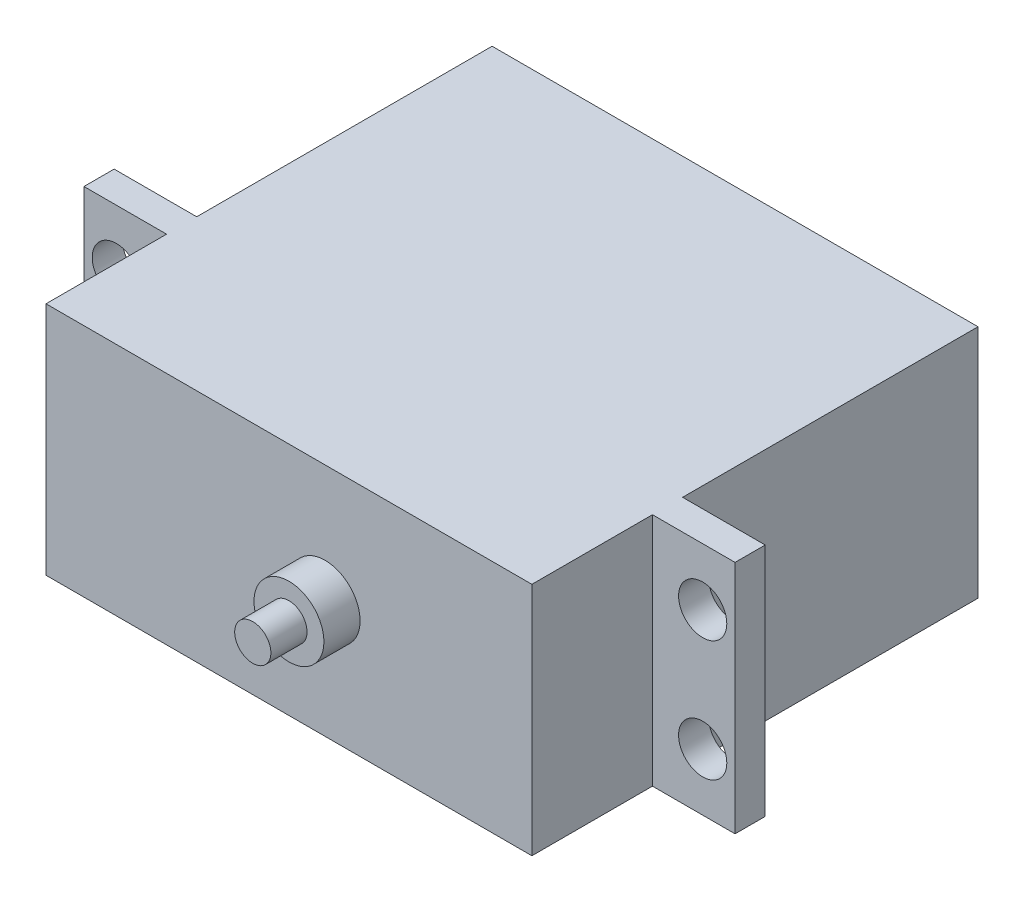
ISO-10303-21;
HEADER;
FILE_DESCRIPTION(('STEP AP214'),'2;1');
FILE_NAME('part.step','',(''),(''),'','','');
FILE_SCHEMA(('AUTOMOTIVE_DESIGN { 1 0 10303 214 1 1 1 1 }'));
ENDSEC;
DATA;
#1=APPLICATION_CONTEXT('core data for automotive mechanical design processes');
#2=APPLICATION_PROTOCOL_DEFINITION('international standard','automotive_design',2000,#1);
#3=PRODUCT_CONTEXT('',#1,'mechanical');
#4=PRODUCT('Part','Part','',(#3));
#5=PRODUCT_RELATED_PRODUCT_CATEGORY('part','',(#4));
#6=PRODUCT_DEFINITION_FORMATION('','',#4);
#7=PRODUCT_DEFINITION_CONTEXT('part definition',#1,'design');
#8=PRODUCT_DEFINITION('design','',#6,#7);
#9=PRODUCT_DEFINITION_SHAPE('','',#8);
#10=(LENGTH_UNIT() NAMED_UNIT(*) SI_UNIT(.MILLI.,.METRE.));
#11=(NAMED_UNIT(*) PLANE_ANGLE_UNIT() SI_UNIT($,.RADIAN.));
#12=(NAMED_UNIT(*) SI_UNIT($,.STERADIAN.) SOLID_ANGLE_UNIT());
#13=UNCERTAINTY_MEASURE_WITH_UNIT(LENGTH_MEASURE(1.E-05),#10,'distance_accuracy_value','');
#14=(GEOMETRIC_REPRESENTATION_CONTEXT(3) GLOBAL_UNCERTAINTY_ASSIGNED_CONTEXT((#13)) GLOBAL_UNIT_ASSIGNED_CONTEXT((#10,
#11,#12)) REPRESENTATION_CONTEXT('',''));
#15=CARTESIAN_POINT('',(0.,0.,0.));
#16=DIRECTION('',(0.,0.,1.));
#17=DIRECTION('',(1.,0.,0.));
#18=AXIS2_PLACEMENT_3D('',#15,#16,#17);
#19=CARTESIAN_POINT('',(20.15,9.75,37.));
#20=DIRECTION('',(-1.,0.,0.));
#21=DIRECTION('',(0.,-1.,0.));
#22=AXIS2_PLACEMENT_3D('',#19,#20,#21);
#23=PLANE('',#22);
#24=DIRECTION('',(0.,1.,0.));
#25=VECTOR('',#24,1.);
#26=CARTESIAN_POINT('',(20.15,9.75,24.5));
#27=LINE('',#26,#25);
#28=CARTESIAN_POINT('',(20.15,-9.75,24.5));
#29=VERTEX_POINT('',#28);
#30=CARTESIAN_POINT('',(20.15,9.75,24.5));
#31=VERTEX_POINT('',#30);
#32=EDGE_CURVE('E144',#29,#31,#27,.T.);
#33=ORIENTED_EDGE('',*,*,#32,.F.);
#34=DIRECTION('',(0.,0.,-1.));
#35=VECTOR('',#34,1.);
#36=CARTESIAN_POINT('',(20.15,-9.75,37.));
#37=LINE('',#36,#35);
#38=CARTESIAN_POINT('',(20.15,-9.75,0.));
#39=VERTEX_POINT('',#38);
#40=EDGE_CURVE('E203',#29,#39,#37,.T.);
#41=ORIENTED_EDGE('',*,*,#40,.T.);
#42=DIRECTION('',(0.,1.,0.));
#43=VECTOR('',#42,1.);
#44=CARTESIAN_POINT('',(20.15,9.75,0.));
#45=LINE('',#44,#43);
#46=CARTESIAN_POINT('',(20.15,9.75,0.));
#47=VERTEX_POINT('',#46);
#48=EDGE_CURVE('E189',#39,#47,#45,.T.);
#49=ORIENTED_EDGE('',*,*,#48,.T.);
#50=DIRECTION('',(0.,0.,-1.));
#51=VECTOR('',#50,1.);
#52=CARTESIAN_POINT('',(20.15,9.75,37.));
#53=LINE('',#52,#51);
#54=EDGE_CURVE('E225',#31,#47,#53,.T.);
#55=ORIENTED_EDGE('',*,*,#54,.F.);
#56=EDGE_LOOP('',(#33,#41,#49,#55));
#57=FACE_BOUND('',#56,.T.);
#58=ADVANCED_FACE('F35',(#57),#23,.F.);
#59=CARTESIAN_POINT('',(-20.15,9.75,37.));
#60=DIRECTION('',(1.,0.,0.));
#61=DIRECTION('',(0.,1.,0.));
#62=AXIS2_PLACEMENT_3D('',#59,#60,#61);
#63=PLANE('',#62);
#64=DIRECTION('',(0.,-1.,0.));
#65=VECTOR('',#64,1.);
#66=CARTESIAN_POINT('',(-20.15,9.75,24.5));
#67=LINE('',#66,#65);
#68=CARTESIAN_POINT('',(-20.15,9.75,24.5));
#69=VERTEX_POINT('',#68);
#70=CARTESIAN_POINT('',(-20.15,-9.75,24.5));
#71=VERTEX_POINT('',#70);
#72=EDGE_CURVE('E180',#69,#71,#67,.T.);
#73=ORIENTED_EDGE('',*,*,#72,.F.);
#74=DIRECTION('',(0.,0.,-1.));
#75=VECTOR('',#74,1.);
#76=CARTESIAN_POINT('',(-20.15,9.75,37.));
#77=LINE('',#76,#75);
#78=CARTESIAN_POINT('',(-20.15,9.75,0.));
#79=VERTEX_POINT('',#78);
#80=EDGE_CURVE('E221',#69,#79,#77,.T.);
#81=ORIENTED_EDGE('',*,*,#80,.T.);
#82=DIRECTION('',(0.,-1.,0.));
#83=VECTOR('',#82,1.);
#84=CARTESIAN_POINT('',(-20.15,9.75,0.));
#85=LINE('',#84,#83);
#86=CARTESIAN_POINT('',(-20.15,-9.75,0.));
#87=VERTEX_POINT('',#86);
#88=EDGE_CURVE('E209',#79,#87,#85,.T.);
#89=ORIENTED_EDGE('',*,*,#88,.T.);
#90=DIRECTION('',(0.,0.,-1.));
#91=VECTOR('',#90,1.);
#92=CARTESIAN_POINT('',(-20.15,-9.75,37.));
#93=LINE('',#92,#91);
#94=EDGE_CURVE('E217',#71,#87,#93,.T.);
#95=ORIENTED_EDGE('',*,*,#94,.F.);
#96=EDGE_LOOP('',(#73,#81,#89,#95));
#97=FACE_BOUND('',#96,.T.);
#98=ADVANCED_FACE('F285',(#97),#63,.F.);
#99=CARTESIAN_POINT('',(20.15,-9.75,37.));
#100=VERTEX_POINT('',#99);
#101=CARTESIAN_POINT('',(20.15,-9.75,27.));
#102=VERTEX_POINT('',#101);
#103=EDGE_CURVE('E214',#100,#102,#37,.T.);
#104=ORIENTED_EDGE('',*,*,#103,.T.);
#105=DIRECTION('',(0.,1.,0.));
#106=VECTOR('',#105,1.);
#107=CARTESIAN_POINT('',(20.15,9.75,27.));
#108=LINE('',#107,#106);
#109=CARTESIAN_POINT('',(20.15,9.75,27.));
#110=VERTEX_POINT('',#109);
#111=EDGE_CURVE('E178',#102,#110,#108,.T.);
#112=ORIENTED_EDGE('',*,*,#111,.T.);
#113=CARTESIAN_POINT('',(20.15,9.75,37.));
#114=VERTEX_POINT('',#113);
#115=EDGE_CURVE('E192',#114,#110,#53,.T.);
#116=ORIENTED_EDGE('',*,*,#115,.F.);
#117=DIRECTION('',(0.,1.,0.));
#118=VECTOR('',#117,1.);
#119=CARTESIAN_POINT('',(20.15,9.75,37.));
#120=LINE('',#119,#118);
#121=EDGE_CURVE('E193',#100,#114,#120,.T.);
#122=ORIENTED_EDGE('',*,*,#121,.F.);
#123=EDGE_LOOP('',(#104,#112,#116,#122));
#124=FACE_BOUND('',#123,.T.);
#125=ADVANCED_FACE('F37',(#124),#23,.F.);
#126=CARTESIAN_POINT('',(-20.15,9.75,37.));
#127=DIRECTION('',(0.,-1.,0.));
#128=DIRECTION('',(0.,0.,-1.));
#129=AXIS2_PLACEMENT_3D('',#126,#127,#128);
#130=PLANE('',#129);
#131=ORIENTED_EDGE('',*,*,#115,.T.);
#132=DIRECTION('',(-1.,0.,0.));
#133=VECTOR('',#132,1.);
#134=CARTESIAN_POINT('',(-27.,9.75,27.));
#135=LINE('',#134,#133);
#136=CARTESIAN_POINT('',(27.,9.75,27.));
#137=VERTEX_POINT('',#136);
#138=EDGE_CURVE('E52',#137,#110,#135,.T.);
#139=ORIENTED_EDGE('',*,*,#138,.F.);
#140=DIRECTION('',(0.,0.,1.));
#141=VECTOR('',#140,1.);
#142=CARTESIAN_POINT('',(27.,9.75,24.5));
#143=LINE('',#142,#141);
#144=CARTESIAN_POINT('',(27.,9.75,24.5));
#145=VERTEX_POINT('',#144);
#146=EDGE_CURVE('E127',#145,#137,#143,.T.);
#147=ORIENTED_EDGE('',*,*,#146,.F.);
#148=DIRECTION('',(-1.,0.,0.));
#149=VECTOR('',#148,1.);
#150=CARTESIAN_POINT('',(-27.,9.75,24.5));
#151=LINE('',#150,#149);
#152=EDGE_CURVE('E131',#145,#31,#151,.T.);
#153=ORIENTED_EDGE('',*,*,#152,.T.);
#154=ORIENTED_EDGE('',*,*,#54,.T.);
#155=DIRECTION('',(-1.,0.,0.));
#156=VECTOR('',#155,1.);
#157=CARTESIAN_POINT('',(-20.15,9.75,0.));
#158=LINE('',#157,#156);
#159=EDGE_CURVE('E206',#47,#79,#158,.T.);
#160=ORIENTED_EDGE('',*,*,#159,.T.);
#161=ORIENTED_EDGE('',*,*,#80,.F.);
#162=CARTESIAN_POINT('',(-27.,9.75,24.5));
#163=VERTEX_POINT('',#162);
#164=EDGE_CURVE('E146',#69,#163,#151,.T.);
#165=ORIENTED_EDGE('',*,*,#164,.T.);
#166=DIRECTION('',(0.,0.,1.));
#167=VECTOR('',#166,1.);
#168=CARTESIAN_POINT('',(-27.,9.75,24.5));
#169=LINE('',#168,#167);
#170=CARTESIAN_POINT('',(-27.,9.75,27.));
#171=VERTEX_POINT('',#170);
#172=EDGE_CURVE('E136',#163,#171,#169,.T.);
#173=ORIENTED_EDGE('',*,*,#172,.T.);
#174=CARTESIAN_POINT('',(-20.15,9.75,27.));
#175=VERTEX_POINT('',#174);
#176=EDGE_CURVE('E166',#175,#171,#135,.T.);
#177=ORIENTED_EDGE('',*,*,#176,.F.);
#178=CARTESIAN_POINT('',(-20.15,9.75,37.));
#179=VERTEX_POINT('',#178);
#180=EDGE_CURVE('E222',#179,#175,#77,.T.);
#181=ORIENTED_EDGE('',*,*,#180,.F.);
#182=DIRECTION('',(-1.,0.,0.));
#183=VECTOR('',#182,1.);
#184=CARTESIAN_POINT('',(-20.15,9.75,37.));
#185=LINE('',#184,#183);
#186=EDGE_CURVE('E196',#114,#179,#185,.T.);
#187=ORIENTED_EDGE('',*,*,#186,.F.);
#188=EDGE_LOOP('',(#131,#139,#147,#153,#154,#160,#161,#165,#173,#177,#181,#187));
#189=FACE_BOUND('',#188,.T.);
#190=ADVANCED_FACE('F130',(#189),#130,.F.);
#191=ORIENTED_EDGE('',*,*,#180,.T.);
#192=DIRECTION('',(0.,-1.,0.));
#193=VECTOR('',#192,1.);
#194=CARTESIAN_POINT('',(-20.15,9.75,27.));
#195=LINE('',#194,#193);
#196=CARTESIAN_POINT('',(-20.15,-9.75,27.));
#197=VERTEX_POINT('',#196);
#198=EDGE_CURVE('E172',#175,#197,#195,.T.);
#199=ORIENTED_EDGE('',*,*,#198,.T.);
#200=CARTESIAN_POINT('',(-20.15,-9.75,37.));
#201=VERTEX_POINT('',#200);
#202=EDGE_CURVE('E218',#201,#197,#93,.T.);
#203=ORIENTED_EDGE('',*,*,#202,.F.);
#204=DIRECTION('',(0.,-1.,0.));
#205=VECTOR('',#204,1.);
#206=CARTESIAN_POINT('',(-20.15,9.75,37.));
#207=LINE('',#206,#205);
#208=EDGE_CURVE('E199',#179,#201,#207,.T.);
#209=ORIENTED_EDGE('',*,*,#208,.F.);
#210=EDGE_LOOP('',(#191,#199,#203,#209));
#211=FACE_BOUND('',#210,.T.);
#212=ADVANCED_FACE('F272',(#211),#63,.F.);
#213=CARTESIAN_POINT('',(-20.15,-9.75,37.));
#214=DIRECTION('',(0.,1.,0.));
#215=DIRECTION('',(0.,0.,1.));
#216=AXIS2_PLACEMENT_3D('',#213,#214,#215);
#217=PLANE('',#216);
#218=ORIENTED_EDGE('',*,*,#202,.T.);
#219=DIRECTION('',(1.,0.,0.));
#220=VECTOR('',#219,1.);
#221=CARTESIAN_POINT('',(-27.,-9.75,27.));
#222=LINE('',#221,#220);
#223=CARTESIAN_POINT('',(-27.,-9.75,27.));
#224=VERTEX_POINT('',#223);
#225=EDGE_CURVE('E60',#224,#197,#222,.T.);
#226=ORIENTED_EDGE('',*,*,#225,.F.);
#227=DIRECTION('',(0.,0.,1.));
#228=VECTOR('',#227,1.);
#229=CARTESIAN_POINT('',(-27.,-9.75,24.5));
#230=LINE('',#229,#228);
#231=CARTESIAN_POINT('',(-27.,-9.75,24.5));
#232=VERTEX_POINT('',#231);
#233=EDGE_CURVE('E173',#232,#224,#230,.T.);
#234=ORIENTED_EDGE('',*,*,#233,.F.);
#235=DIRECTION('',(1.,0.,0.));
#236=VECTOR('',#235,1.);
#237=CARTESIAN_POINT('',(-27.,-9.75,24.5));
#238=LINE('',#237,#236);
#239=EDGE_CURVE('E137',#232,#71,#238,.T.);
#240=ORIENTED_EDGE('',*,*,#239,.T.);
#241=ORIENTED_EDGE('',*,*,#94,.T.);
#242=DIRECTION('',(1.,0.,0.));
#243=VECTOR('',#242,1.);
#244=CARTESIAN_POINT('',(-20.15,-9.75,0.));
#245=LINE('',#244,#243);
#246=EDGE_CURVE('E197',#87,#39,#245,.T.);
#247=ORIENTED_EDGE('',*,*,#246,.T.);
#248=ORIENTED_EDGE('',*,*,#40,.F.);
#249=CARTESIAN_POINT('',(27.,-9.75,24.5));
#250=VERTEX_POINT('',#249);
#251=EDGE_CURVE('E161',#29,#250,#238,.T.);
#252=ORIENTED_EDGE('',*,*,#251,.T.);
#253=DIRECTION('',(0.,0.,1.));
#254=VECTOR('',#253,1.);
#255=CARTESIAN_POINT('',(27.,-9.75,24.5));
#256=LINE('',#255,#254);
#257=CARTESIAN_POINT('',(27.,-9.75,27.));
#258=VERTEX_POINT('',#257);
#259=EDGE_CURVE('E151',#250,#258,#256,.T.);
#260=ORIENTED_EDGE('',*,*,#259,.T.);
#261=EDGE_CURVE('E153',#102,#258,#222,.T.);
#262=ORIENTED_EDGE('',*,*,#261,.F.);
#263=ORIENTED_EDGE('',*,*,#103,.F.);
#264=DIRECTION('',(1.,0.,0.));
#265=VECTOR('',#264,1.);
#266=CARTESIAN_POINT('',(-20.15,-9.75,37.));
#267=LINE('',#266,#265);
#268=EDGE_CURVE('E201',#201,#100,#267,.T.);
#269=ORIENTED_EDGE('',*,*,#268,.F.);
#270=EDGE_LOOP('',(#218,#226,#234,#240,#241,#247,#248,#252,#260,#262,#263,#269));
#271=FACE_BOUND('',#270,.T.);
#272=ADVANCED_FACE('F263',(#271),#217,.F.);
#273=CARTESIAN_POINT('',(0.,0.,37.));
#274=DIRECTION('',(0.,0.,1.));
#275=DIRECTION('',(1.,0.,0.));
#276=AXIS2_PLACEMENT_3D('',#273,#274,#275);
#277=PLANE('',#276);
#278=CARTESIAN_POINT('',(3.00000000000001,0.,37.));
#279=DIRECTION('',(0.,0.,1.));
#280=DIRECTION('',(1.,0.,0.));
#281=AXIS2_PLACEMENT_3D('',#278,#279,#280);
#282=CIRCLE('',#281,2.9);
#283=CARTESIAN_POINT('',(5.90000000000001,0.,37.));
#284=VERTEX_POINT('',#283);
#285=EDGE_CURVE('E44',#284,#284,#282,.T.);
#286=ORIENTED_EDGE('',*,*,#285,.F.);
#287=EDGE_LOOP('',(#286));
#288=FACE_BOUND('',#287,.T.);
#289=ORIENTED_EDGE('',*,*,#121,.T.);
#290=ORIENTED_EDGE('',*,*,#186,.T.);
#291=ORIENTED_EDGE('',*,*,#208,.T.);
#292=ORIENTED_EDGE('',*,*,#268,.T.);
#293=EDGE_LOOP('',(#289,#290,#291,#292));
#294=FACE_BOUND('',#293,.T.);
#295=ADVANCED_FACE('F267',(#288,#294),#277,.T.);
#296=CARTESIAN_POINT('',(0.,0.,0.));
#297=DIRECTION('',(0.,0.,1.));
#298=DIRECTION('',(1.,0.,0.));
#299=AXIS2_PLACEMENT_3D('',#296,#297,#298);
#300=PLANE('',#299);
#301=ORIENTED_EDGE('',*,*,#48,.F.);
#302=ORIENTED_EDGE('',*,*,#246,.F.);
#303=ORIENTED_EDGE('',*,*,#88,.F.);
#304=ORIENTED_EDGE('',*,*,#159,.F.);
#305=EDGE_LOOP('',(#301,#302,#303,#304));
#306=FACE_BOUND('',#305,.T.);
#307=ADVANCED_FACE('F291',(#306),#300,.F.);
#308=CARTESIAN_POINT('',(3.00000000000001,0.,40.));
#309=DIRECTION('',(0.,0.,-1.));
#310=DIRECTION('',(-1.,0.,0.));
#311=AXIS2_PLACEMENT_3D('',#308,#309,#310);
#312=CYLINDRICAL_SURFACE('',#311,2.9);
#313=CARTESIAN_POINT('',(3.00000000000001,0.,40.));
#314=DIRECTION('',(0.,0.,1.));
#315=DIRECTION('',(1.,0.,0.));
#316=AXIS2_PLACEMENT_3D('',#313,#314,#315);
#317=CIRCLE('',#316,2.9);
#318=CARTESIAN_POINT('',(5.90000000000001,0.,40.));
#319=VERTEX_POINT('',#318);
#320=EDGE_CURVE('E185',#319,#319,#317,.T.);
#321=ORIENTED_EDGE('',*,*,#320,.F.);
#322=EDGE_LOOP('',(#321));
#323=FACE_BOUND('',#322,.T.);
#324=ORIENTED_EDGE('',*,*,#285,.T.);
#325=EDGE_LOOP('',(#324));
#326=FACE_BOUND('',#325,.T.);
#327=ADVANCED_FACE('F311',(#323,#326),#312,.T.);
#328=CARTESIAN_POINT('',(3.00000000000001,0.,40.));
#329=DIRECTION('',(0.,0.,1.));
#330=DIRECTION('',(1.,0.,0.));
#331=AXIS2_PLACEMENT_3D('',#328,#329,#330);
#332=PLANE('',#331);
#333=CARTESIAN_POINT('',(3.00000000000001,0.,40.));
#334=DIRECTION('',(0.,0.,1.));
#335=DIRECTION('',(1.,0.,0.));
#336=AXIS2_PLACEMENT_3D('',#333,#334,#335);
#337=CIRCLE('',#336,1.5);
#338=CARTESIAN_POINT('',(4.50000000000001,0.,40.));
#339=VERTEX_POINT('',#338);
#340=EDGE_CURVE('E11',#339,#339,#337,.T.);
#341=ORIENTED_EDGE('',*,*,#340,.F.);
#342=EDGE_LOOP('',(#341));
#343=FACE_BOUND('',#342,.T.);
#344=ORIENTED_EDGE('',*,*,#320,.T.);
#345=EDGE_LOOP('',(#344));
#346=FACE_BOUND('',#345,.T.);
#347=ADVANCED_FACE('F317',(#343,#346),#332,.T.);
#348=CARTESIAN_POINT('',(3.00000000000001,0.,43.));
#349=DIRECTION('',(0.,0.,-1.));
#350=DIRECTION('',(-1.,0.,0.));
#351=AXIS2_PLACEMENT_3D('',#348,#349,#350);
#352=CYLINDRICAL_SURFACE('',#351,1.5);
#353=CARTESIAN_POINT('',(3.00000000000001,0.,43.));
#354=DIRECTION('',(0.,0.,1.));
#355=DIRECTION('',(1.,0.,0.));
#356=AXIS2_PLACEMENT_3D('',#353,#354,#355);
#357=CIRCLE('',#356,1.5);
#358=CARTESIAN_POINT('',(4.50000000000001,0.,43.));
#359=VERTEX_POINT('',#358);
#360=EDGE_CURVE('E183',#359,#359,#357,.T.);
#361=ORIENTED_EDGE('',*,*,#360,.F.);
#362=EDGE_LOOP('',(#361));
#363=FACE_BOUND('',#362,.T.);
#364=ORIENTED_EDGE('',*,*,#340,.T.);
#365=EDGE_LOOP('',(#364));
#366=FACE_BOUND('',#365,.T.);
#367=ADVANCED_FACE('F321',(#363,#366),#352,.T.);
#368=CARTESIAN_POINT('',(3.00000000000001,0.,43.));
#369=DIRECTION('',(0.,0.,1.));
#370=DIRECTION('',(1.,0.,0.));
#371=AXIS2_PLACEMENT_3D('',#368,#369,#370);
#372=PLANE('',#371);
#373=ORIENTED_EDGE('',*,*,#360,.T.);
#374=EDGE_LOOP('',(#373));
#375=FACE_BOUND('',#374,.T.);
#376=ADVANCED_FACE('F325',(#375),#372,.T.);
#377=CARTESIAN_POINT('',(-27.,9.75,24.5));
#378=DIRECTION('',(-1.,0.,0.));
#379=DIRECTION('',(0.,-1.,0.));
#380=AXIS2_PLACEMENT_3D('',#377,#378,#379);
#381=PLANE('',#380);
#382=DIRECTION('',(0.,-1.,0.));
#383=VECTOR('',#382,1.);
#384=CARTESIAN_POINT('',(-27.,9.75,27.));
#385=LINE('',#384,#383);
#386=EDGE_CURVE('E169',#171,#224,#385,.T.);
#387=ORIENTED_EDGE('',*,*,#386,.F.);
#388=ORIENTED_EDGE('',*,*,#172,.F.);
#389=DIRECTION('',(0.,-1.,0.));
#390=VECTOR('',#389,1.);
#391=CARTESIAN_POINT('',(-27.,9.75,24.5));
#392=LINE('',#391,#390);
#393=EDGE_CURVE('E145',#163,#232,#392,.T.);
#394=ORIENTED_EDGE('',*,*,#393,.T.);
#395=ORIENTED_EDGE('',*,*,#233,.T.);
#396=EDGE_LOOP('',(#387,#388,#394,#395));
#397=FACE_BOUND('',#396,.T.);
#398=ADVANCED_FACE('F279',(#397),#381,.T.);
#399=CARTESIAN_POINT('',(0.,0.,27.));
#400=DIRECTION('',(0.,0.,1.));
#401=DIRECTION('',(1.,0.,0.));
#402=AXIS2_PLACEMENT_3D('',#399,#400,#401);
#403=PLANE('',#402);
#404=CARTESIAN_POINT('',(-24.315,5.,27.));
#405=DIRECTION('',(0.,0.,1.));
#406=DIRECTION('',(1.,0.,0.));
#407=AXIS2_PLACEMENT_3D('',#404,#405,#406);
#408=CIRCLE('',#407,2.);
#409=CARTESIAN_POINT('',(-22.315,5.,27.));
#410=VERTEX_POINT('',#409);
#411=EDGE_CURVE('E242',#410,#410,#408,.T.);
#412=ORIENTED_EDGE('',*,*,#411,.F.);
#413=EDGE_LOOP('',(#412));
#414=FACE_BOUND('',#413,.T.);
#415=CARTESIAN_POINT('',(-24.315,-5.,27.));
#416=DIRECTION('',(0.,0.,1.));
#417=DIRECTION('',(1.,0.,0.));
#418=AXIS2_PLACEMENT_3D('',#415,#416,#417);
#419=CIRCLE('',#418,2.);
#420=CARTESIAN_POINT('',(-22.315,-5.,27.));
#421=VERTEX_POINT('',#420);
#422=EDGE_CURVE('E231',#421,#421,#419,.T.);
#423=ORIENTED_EDGE('',*,*,#422,.F.);
#424=EDGE_LOOP('',(#423));
#425=FACE_BOUND('',#424,.T.);
#426=ORIENTED_EDGE('',*,*,#198,.F.);
#427=ORIENTED_EDGE('',*,*,#176,.T.);
#428=ORIENTED_EDGE('',*,*,#386,.T.);
#429=ORIENTED_EDGE('',*,*,#225,.T.);
#430=EDGE_LOOP('',(#426,#427,#428,#429));
#431=FACE_BOUND('',#430,.T.);
#432=ADVANCED_FACE('F257',(#414,#425,#431),#403,.T.);
#433=CARTESIAN_POINT('',(0.,0.,24.5));
#434=DIRECTION('',(0.,0.,1.));
#435=DIRECTION('',(1.,0.,0.));
#436=AXIS2_PLACEMENT_3D('',#433,#434,#435);
#437=PLANE('',#436);
#438=CARTESIAN_POINT('',(-24.315,5.,24.5));
#439=DIRECTION('',(0.,0.,1.));
#440=DIRECTION('',(1.,0.,0.));
#441=AXIS2_PLACEMENT_3D('',#438,#439,#440);
#442=CIRCLE('',#441,2.);
#443=CARTESIAN_POINT('',(-22.315,5.,24.5));
#444=VERTEX_POINT('',#443);
#445=EDGE_CURVE('E39',#444,#444,#442,.T.);
#446=ORIENTED_EDGE('',*,*,#445,.T.);
#447=EDGE_LOOP('',(#446));
#448=FACE_BOUND('',#447,.T.);
#449=CARTESIAN_POINT('',(-24.315,-5.,24.5));
#450=DIRECTION('',(0.,0.,1.));
#451=DIRECTION('',(1.,0.,0.));
#452=AXIS2_PLACEMENT_3D('',#449,#450,#451);
#453=CIRCLE('',#452,2.);
#454=CARTESIAN_POINT('',(-22.315,-5.,24.5));
#455=VERTEX_POINT('',#454);
#456=EDGE_CURVE('E228',#455,#455,#453,.T.);
#457=ORIENTED_EDGE('',*,*,#456,.T.);
#458=EDGE_LOOP('',(#457));
#459=FACE_BOUND('',#458,.T.);
#460=ORIENTED_EDGE('',*,*,#164,.F.);
#461=ORIENTED_EDGE('',*,*,#72,.T.);
#462=ORIENTED_EDGE('',*,*,#239,.F.);
#463=ORIENTED_EDGE('',*,*,#393,.F.);
#464=EDGE_LOOP('',(#460,#461,#462,#463));
#465=FACE_BOUND('',#464,.T.);
#466=ADVANCED_FACE('F336',(#448,#459,#465),#437,.F.);
#467=CARTESIAN_POINT('',(24.315,-5.,24.5));
#468=DIRECTION('',(0.,0.,1.));
#469=DIRECTION('',(1.,0.,0.));
#470=AXIS2_PLACEMENT_3D('',#467,#468,#469);
#471=CIRCLE('',#470,2.);
#472=CARTESIAN_POINT('',(26.315,-5.,24.5));
#473=VERTEX_POINT('',#472);
#474=EDGE_CURVE('E235',#473,#473,#471,.T.);
#475=ORIENTED_EDGE('',*,*,#474,.T.);
#476=EDGE_LOOP('',(#475));
#477=FACE_BOUND('',#476,.T.);
#478=CARTESIAN_POINT('',(24.315,5.,24.5));
#479=DIRECTION('',(0.,0.,1.));
#480=DIRECTION('',(1.,0.,0.));
#481=AXIS2_PLACEMENT_3D('',#478,#479,#480);
#482=CIRCLE('',#481,2.);
#483=CARTESIAN_POINT('',(26.315,5.,24.5));
#484=VERTEX_POINT('',#483);
#485=EDGE_CURVE('E167',#484,#484,#482,.T.);
#486=ORIENTED_EDGE('',*,*,#485,.T.);
#487=EDGE_LOOP('',(#486));
#488=FACE_BOUND('',#487,.T.);
#489=ORIENTED_EDGE('',*,*,#251,.F.);
#490=ORIENTED_EDGE('',*,*,#32,.T.);
#491=ORIENTED_EDGE('',*,*,#152,.F.);
#492=DIRECTION('',(0.,1.,0.));
#493=VECTOR('',#492,1.);
#494=CARTESIAN_POINT('',(27.,9.75,24.5));
#495=LINE('',#494,#493);
#496=EDGE_CURVE('E142',#250,#145,#495,.T.);
#497=ORIENTED_EDGE('',*,*,#496,.F.);
#498=EDGE_LOOP('',(#489,#490,#491,#497));
#499=FACE_BOUND('',#498,.T.);
#500=ADVANCED_FACE('F141',(#477,#488,#499),#437,.F.);
#501=CARTESIAN_POINT('',(24.315,-5.,27.));
#502=DIRECTION('',(0.,0.,1.));
#503=DIRECTION('',(1.,0.,0.));
#504=AXIS2_PLACEMENT_3D('',#501,#502,#503);
#505=CIRCLE('',#504,2.);
#506=CARTESIAN_POINT('',(26.315,-5.,27.));
#507=VERTEX_POINT('',#506);
#508=EDGE_CURVE('E230',#507,#507,#505,.T.);
#509=ORIENTED_EDGE('',*,*,#508,.F.);
#510=EDGE_LOOP('',(#509));
#511=FACE_BOUND('',#510,.T.);
#512=CARTESIAN_POINT('',(24.315,5.,27.));
#513=DIRECTION('',(0.,0.,1.));
#514=DIRECTION('',(1.,0.,0.));
#515=AXIS2_PLACEMENT_3D('',#512,#513,#514);
#516=CIRCLE('',#515,2.);
#517=CARTESIAN_POINT('',(26.315,5.,27.));
#518=VERTEX_POINT('',#517);
#519=EDGE_CURVE('E156',#518,#518,#516,.T.);
#520=ORIENTED_EDGE('',*,*,#519,.F.);
#521=EDGE_LOOP('',(#520));
#522=FACE_BOUND('',#521,.T.);
#523=ORIENTED_EDGE('',*,*,#111,.F.);
#524=ORIENTED_EDGE('',*,*,#261,.T.);
#525=DIRECTION('',(0.,1.,0.));
#526=VECTOR('',#525,1.);
#527=CARTESIAN_POINT('',(27.,9.75,27.));
#528=LINE('',#527,#526);
#529=EDGE_CURVE('E164',#258,#137,#528,.T.);
#530=ORIENTED_EDGE('',*,*,#529,.T.);
#531=ORIENTED_EDGE('',*,*,#138,.T.);
#532=EDGE_LOOP('',(#523,#524,#530,#531));
#533=FACE_BOUND('',#532,.T.);
#534=ADVANCED_FACE('F253',(#511,#522,#533),#403,.T.);
#535=CARTESIAN_POINT('',(27.,9.75,24.5));
#536=DIRECTION('',(1.,0.,0.));
#537=DIRECTION('',(0.,1.,0.));
#538=AXIS2_PLACEMENT_3D('',#535,#536,#537);
#539=PLANE('',#538);
#540=ORIENTED_EDGE('',*,*,#529,.F.);
#541=ORIENTED_EDGE('',*,*,#259,.F.);
#542=ORIENTED_EDGE('',*,*,#496,.T.);
#543=ORIENTED_EDGE('',*,*,#146,.T.);
#544=EDGE_LOOP('',(#540,#541,#542,#543));
#545=FACE_BOUND('',#544,.T.);
#546=ADVANCED_FACE('F149',(#545),#539,.T.);
#547=CARTESIAN_POINT('',(24.315,5.,27.));
#548=DIRECTION('',(0.,0.,1.));
#549=DIRECTION('',(1.,0.,0.));
#550=AXIS2_PLACEMENT_3D('',#547,#548,#549);
#551=CYLINDRICAL_SURFACE('',#550,2.);
#552=ORIENTED_EDGE('',*,*,#519,.T.);
#553=EDGE_LOOP('',(#552));
#554=FACE_BOUND('',#553,.T.);
#555=ORIENTED_EDGE('',*,*,#485,.F.);
#556=EDGE_LOOP('',(#555));
#557=FACE_BOUND('',#556,.T.);
#558=ADVANCED_FACE('F250',(#554,#557),#551,.F.);
#559=CARTESIAN_POINT('',(24.315,-5.,27.));
#560=DIRECTION('',(0.,0.,1.));
#561=DIRECTION('',(1.,0.,0.));
#562=AXIS2_PLACEMENT_3D('',#559,#560,#561);
#563=CYLINDRICAL_SURFACE('',#562,2.);
#564=ORIENTED_EDGE('',*,*,#508,.T.);
#565=EDGE_LOOP('',(#564));
#566=FACE_BOUND('',#565,.T.);
#567=ORIENTED_EDGE('',*,*,#474,.F.);
#568=EDGE_LOOP('',(#567));
#569=FACE_BOUND('',#568,.T.);
#570=ADVANCED_FACE('F339',(#566,#569),#563,.F.);
#571=CARTESIAN_POINT('',(-24.315,-5.,27.));
#572=DIRECTION('',(0.,0.,1.));
#573=DIRECTION('',(1.,0.,0.));
#574=AXIS2_PLACEMENT_3D('',#571,#572,#573);
#575=CYLINDRICAL_SURFACE('',#574,2.);
#576=ORIENTED_EDGE('',*,*,#422,.T.);
#577=EDGE_LOOP('',(#576));
#578=FACE_BOUND('',#577,.T.);
#579=ORIENTED_EDGE('',*,*,#456,.F.);
#580=EDGE_LOOP('',(#579));
#581=FACE_BOUND('',#580,.T.);
#582=ADVANCED_FACE('F342',(#578,#581),#575,.F.);
#583=CARTESIAN_POINT('',(-24.315,5.,27.));
#584=DIRECTION('',(0.,0.,1.));
#585=DIRECTION('',(1.,0.,0.));
#586=AXIS2_PLACEMENT_3D('',#583,#584,#585);
#587=CYLINDRICAL_SURFACE('',#586,2.);
#588=ORIENTED_EDGE('',*,*,#411,.T.);
#589=EDGE_LOOP('',(#588));
#590=FACE_BOUND('',#589,.T.);
#591=ORIENTED_EDGE('',*,*,#445,.F.);
#592=EDGE_LOOP('',(#591));
#593=FACE_BOUND('',#592,.T.);
#594=ADVANCED_FACE('F346',(#590,#593),#587,.F.);
#595=CLOSED_SHELL('',(#58,#98,#125,#190,#212,#272,#295,#307,#327,#347,#367,#376,#398,#432,#466,
#500,#534,#546,#558,#570,#582,#594));
#596=MANIFOLD_SOLID_BREP('B2',#595);
#597=ADVANCED_BREP_SHAPE_REPRESENTATION('',(#18,#596),#14);
#598=SHAPE_DEFINITION_REPRESENTATION(#9,#597);
ENDSEC;
END-ISO-10303-21;
